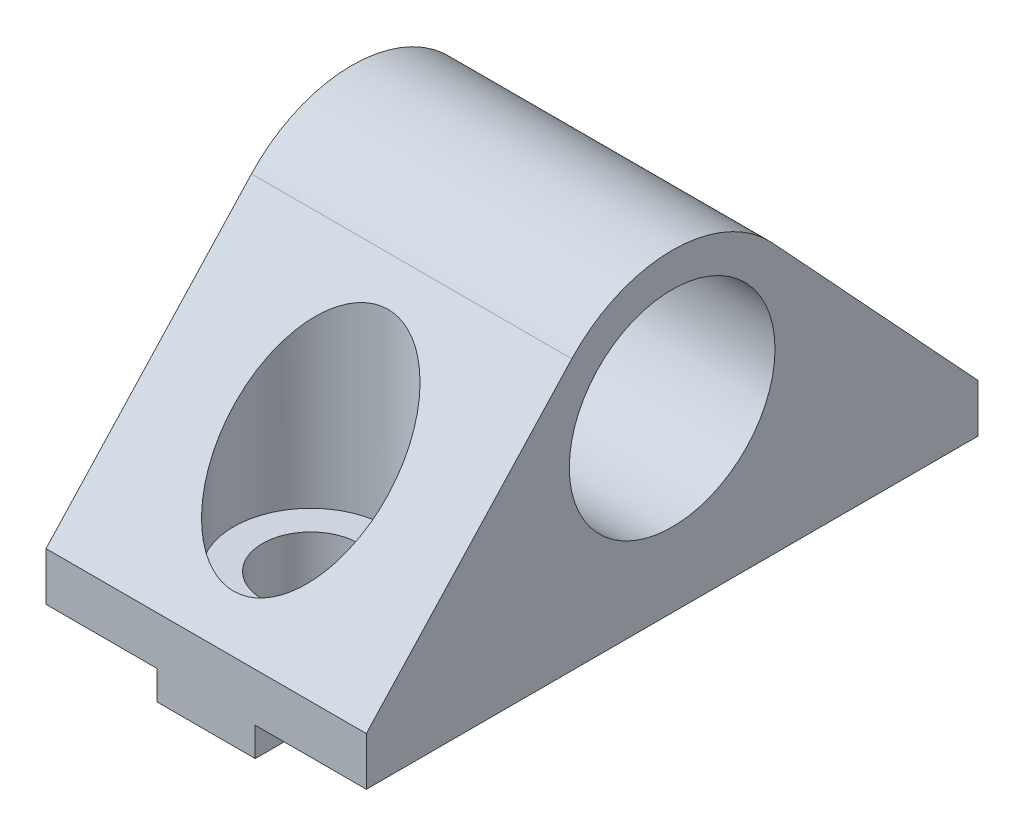
ISO-10303-21;
HEADER;
FILE_DESCRIPTION(('STEP AP214'),'2;1');
FILE_NAME('part.step','',(''),(''),'','','');
FILE_SCHEMA(('AUTOMOTIVE_DESIGN { 1 0 10303 214 1 1 1 1 }'));
ENDSEC;
DATA;
#1=APPLICATION_CONTEXT('core data for automotive mechanical design processes');
#2=APPLICATION_PROTOCOL_DEFINITION('international standard','automotive_design',2000,#1);
#3=PRODUCT_CONTEXT('',#1,'mechanical');
#4=PRODUCT('Part','Part','',(#3));
#5=PRODUCT_RELATED_PRODUCT_CATEGORY('part','',(#4));
#6=PRODUCT_DEFINITION_FORMATION('','',#4);
#7=PRODUCT_DEFINITION_CONTEXT('part definition',#1,'design');
#8=PRODUCT_DEFINITION('design','',#6,#7);
#9=PRODUCT_DEFINITION_SHAPE('','',#8);
#10=(LENGTH_UNIT() NAMED_UNIT(*) SI_UNIT(.MILLI.,.METRE.));
#11=(NAMED_UNIT(*) PLANE_ANGLE_UNIT() SI_UNIT($,.RADIAN.));
#12=(NAMED_UNIT(*) SI_UNIT($,.STERADIAN.) SOLID_ANGLE_UNIT());
#13=UNCERTAINTY_MEASURE_WITH_UNIT(LENGTH_MEASURE(1.E-05),#10,'distance_accuracy_value','');
#14=(GEOMETRIC_REPRESENTATION_CONTEXT(3) GLOBAL_UNCERTAINTY_ASSIGNED_CONTEXT((#13)) GLOBAL_UNIT_ASSIGNED_CONTEXT((#10,
#11,#12)) REPRESENTATION_CONTEXT('',''));
#15=CARTESIAN_POINT('',(0.,0.,0.));
#16=DIRECTION('',(0.,0.,1.));
#17=DIRECTION('',(1.,0.,0.));
#18=AXIS2_PLACEMENT_3D('',#15,#16,#17);
#19=CARTESIAN_POINT('',(101.606176910239,198.484265544604,-38.));
#20=DIRECTION('',(-1.,0.,0.));
#21=DIRECTION('',(0.,-1.,0.));
#22=AXIS2_PLACEMENT_3D('',#19,#20,#21);
#23=PLANE('',#22);
#24=DIRECTION('',(0.,-1.,0.));
#25=VECTOR('',#24,1.);
#26=CARTESIAN_POINT('',(101.606176910239,198.484265544604,0.));
#27=LINE('',#26,#25);
#28=CARTESIAN_POINT('',(101.606176910238,198.484265544604,0.));
#29=VERTEX_POINT('',#28);
#30=CARTESIAN_POINT('',(101.606176910239,195.484265544604,0.));
#31=VERTEX_POINT('',#30);
#32=EDGE_CURVE('E131',#29,#31,#27,.T.);
#33=ORIENTED_EDGE('',*,*,#32,.F.);
#34=DIRECTION('',(0.,0.733536752395156,-0.679649786938514));
#35=VECTOR('',#34,1.);
#36=CARTESIAN_POINT('',(101.606176910238,212.261288733581,-12.7649376046412));
#37=LINE('',#36,#35);
#38=CARTESIAN_POINT('',(101.606176910238,212.261288733581,-12.7649376046412));
#39=VERTEX_POINT('',#38);
#40=EDGE_CURVE('E189',#29,#39,#37,.T.);
#41=ORIENTED_EDGE('',*,*,#40,.T.);
#42=CARTESIAN_POINT('',(101.606176910238,206.484265544604,-19.));
#43=DIRECTION('',(-1.,0.,0.));
#44=DIRECTION('',(0.,0.,-1.));
#45=AXIS2_PLACEMENT_3D('',#42,#43,#44);
#46=CIRCLE('',#45,8.50000000000001);
#47=CARTESIAN_POINT('',(101.606176910238,212.261288733581,-25.2350623953588));
#48=VERTEX_POINT('',#47);
#49=EDGE_CURVE('E204',#39,#48,#46,.T.);
#50=ORIENTED_EDGE('',*,*,#49,.T.);
#51=DIRECTION('',(0.,-0.733536752395156,-0.679649786938514));
#52=VECTOR('',#51,1.);
#53=CARTESIAN_POINT('',(101.606176910238,198.484265544604,-38.));
#54=LINE('',#53,#52);
#55=CARTESIAN_POINT('',(101.606176910239,198.484265544604,-38.));
#56=VERTEX_POINT('',#55);
#57=EDGE_CURVE('E196',#48,#56,#54,.T.);
#58=ORIENTED_EDGE('',*,*,#57,.T.);
#59=DIRECTION('',(0.,-1.,0.));
#60=VECTOR('',#59,1.);
#61=CARTESIAN_POINT('',(101.606176910239,198.484265544604,-38.));
#62=LINE('',#61,#60);
#63=CARTESIAN_POINT('',(101.606176910239,195.484265544604,-38.));
#64=VERTEX_POINT('',#63);
#65=EDGE_CURVE('E52',#56,#64,#62,.T.);
#66=ORIENTED_EDGE('',*,*,#65,.T.);
#67=DIRECTION('',(0.,0.,1.));
#68=VECTOR('',#67,1.);
#69=CARTESIAN_POINT('',(101.606176910239,195.484265544604,-38.));
#70=LINE('',#69,#68);
#71=EDGE_CURVE('E93',#64,#31,#70,.T.);
#72=ORIENTED_EDGE('',*,*,#71,.T.);
#73=EDGE_LOOP('',(#33,#41,#50,#58,#66,#72));
#74=FACE_BOUND('',#73,.T.);
#75=CARTESIAN_POINT('',(101.606176910238,206.484265544604,-19.));
#76=DIRECTION('',(-1.,0.,0.));
#77=DIRECTION('',(0.,0.,1.));
#78=AXIS2_PLACEMENT_3D('',#75,#76,#77);
#79=CIRCLE('',#78,6.39);
#80=CARTESIAN_POINT('',(101.606176910238,206.484265544604,-12.61));
#81=VERTEX_POINT('',#80);
#82=EDGE_CURVE('E166',#81,#81,#79,.T.);
#83=ORIENTED_EDGE('',*,*,#82,.F.);
#84=EDGE_LOOP('',(#83));
#85=FACE_BOUND('',#84,.T.);
#86=ADVANCED_FACE('F34',(#74,#85),#23,.T.);
#87=CARTESIAN_POINT('',(121.506176910239,195.484265544604,-38.));
#88=DIRECTION('',(1.,0.,0.));
#89=DIRECTION('',(0.,0.,-1.));
#90=AXIS2_PLACEMENT_3D('',#87,#88,#89);
#91=PLANE('',#90);
#92=DIRECTION('',(0.,1.,0.));
#93=VECTOR('',#92,1.);
#94=CARTESIAN_POINT('',(121.506176910239,195.484265544604,0.));
#95=LINE('',#94,#93);
#96=CARTESIAN_POINT('',(121.506176910239,195.484265544604,0.));
#97=VERTEX_POINT('',#96);
#98=CARTESIAN_POINT('',(121.506176910239,198.484265544604,0.));
#99=VERTEX_POINT('',#98);
#100=EDGE_CURVE('E85',#97,#99,#95,.T.);
#101=ORIENTED_EDGE('',*,*,#100,.F.);
#102=DIRECTION('',(0.,0.,1.));
#103=VECTOR('',#102,1.);
#104=CARTESIAN_POINT('',(121.506176910239,195.484265544604,-38.));
#105=LINE('',#104,#103);
#106=CARTESIAN_POINT('',(121.506176910239,195.484265544604,-38.));
#107=VERTEX_POINT('',#106);
#108=EDGE_CURVE('E11',#107,#97,#105,.T.);
#109=ORIENTED_EDGE('',*,*,#108,.F.);
#110=DIRECTION('',(0.,1.,0.));
#111=VECTOR('',#110,1.);
#112=CARTESIAN_POINT('',(121.506176910239,195.484265544604,-38.));
#113=LINE('',#112,#111);
#114=CARTESIAN_POINT('',(121.506176910239,198.484265544604,-38.));
#115=VERTEX_POINT('',#114);
#116=EDGE_CURVE('E113',#107,#115,#113,.T.);
#117=ORIENTED_EDGE('',*,*,#116,.T.);
#118=DIRECTION('',(0.,-0.733536752395156,-0.679649786938514));
#119=VECTOR('',#118,1.);
#120=CARTESIAN_POINT('',(121.506176910239,198.484265544604,-38.));
#121=LINE('',#120,#119);
#122=CARTESIAN_POINT('',(121.506176910239,212.261288733581,-25.2350623953588));
#123=VERTEX_POINT('',#122);
#124=EDGE_CURVE('E199',#123,#115,#121,.T.);
#125=ORIENTED_EDGE('',*,*,#124,.F.);
#126=CARTESIAN_POINT('',(121.506176910239,206.484265544604,-19.));
#127=DIRECTION('',(-1.,0.,0.));
#128=DIRECTION('',(0.,0.,-1.));
#129=AXIS2_PLACEMENT_3D('',#126,#127,#128);
#130=CIRCLE('',#129,8.50000000000001);
#131=CARTESIAN_POINT('',(121.506176910239,212.261288733581,-12.7649376046412));
#132=VERTEX_POINT('',#131);
#133=EDGE_CURVE('E195',#132,#123,#130,.T.);
#134=ORIENTED_EDGE('',*,*,#133,.F.);
#135=DIRECTION('',(0.,0.733536752395156,-0.679649786938514));
#136=VECTOR('',#135,1.);
#137=CARTESIAN_POINT('',(121.506176910239,212.261288733581,-12.7649376046412));
#138=LINE('',#137,#136);
#139=EDGE_CURVE('E192',#99,#132,#138,.T.);
#140=ORIENTED_EDGE('',*,*,#139,.F.);
#141=EDGE_LOOP('',(#101,#109,#117,#125,#134,#140));
#142=FACE_BOUND('',#141,.T.);
#143=CARTESIAN_POINT('',(121.506176910239,206.484265544604,-19.));
#144=DIRECTION('',(-1.,0.,0.));
#145=DIRECTION('',(0.,0.,1.));
#146=AXIS2_PLACEMENT_3D('',#143,#144,#145);
#147=CIRCLE('',#146,6.39);
#148=CARTESIAN_POINT('',(121.506176910239,206.484265544604,-12.61));
#149=VERTEX_POINT('',#148);
#150=EDGE_CURVE('E186',#149,#149,#147,.T.);
#151=ORIENTED_EDGE('',*,*,#150,.T.);
#152=EDGE_LOOP('',(#151));
#153=FACE_BOUND('',#152,.T.);
#154=ADVANCED_FACE('F110',(#142,#153),#91,.T.);
#155=CARTESIAN_POINT('',(114.604851947764,195.484265544604,-38.));
#156=DIRECTION('',(0.,-1.,0.));
#157=DIRECTION('',(0.,0.,-1.));
#158=AXIS2_PLACEMENT_3D('',#155,#156,#157);
#159=PLANE('',#158);
#160=DIRECTION('',(1.,0.,0.));
#161=VECTOR('',#160,1.);
#162=CARTESIAN_POINT('',(114.604851947764,195.484265544604,0.));
#163=LINE('',#162,#161);
#164=CARTESIAN_POINT('',(114.604851947764,195.484265544604,0.));
#165=VERTEX_POINT('',#164);
#166=EDGE_CURVE('E147',#165,#97,#163,.T.);
#167=ORIENTED_EDGE('',*,*,#166,.F.);
#168=DIRECTION('',(0.,0.,1.));
#169=VECTOR('',#168,1.);
#170=CARTESIAN_POINT('',(114.604851947764,195.484265544604,-38.));
#171=LINE('',#170,#169);
#172=CARTESIAN_POINT('',(114.604851947764,195.484265544604,-38.));
#173=VERTEX_POINT('',#172);
#174=EDGE_CURVE('E43',#173,#165,#171,.T.);
#175=ORIENTED_EDGE('',*,*,#174,.F.);
#176=DIRECTION('',(1.,0.,0.));
#177=VECTOR('',#176,1.);
#178=CARTESIAN_POINT('',(114.604851947764,195.484265544604,-38.));
#179=LINE('',#178,#177);
#180=EDGE_CURVE('E118',#173,#107,#179,.T.);
#181=ORIENTED_EDGE('',*,*,#180,.T.);
#182=ORIENTED_EDGE('',*,*,#108,.T.);
#183=EDGE_LOOP('',(#167,#175,#181,#182));
#184=FACE_BOUND('',#183,.T.);
#185=ADVANCED_FACE('F123',(#184),#159,.T.);
#186=CARTESIAN_POINT('',(114.604851947764,193.684265544604,-38.));
#187=DIRECTION('',(1.,0.,0.));
#188=DIRECTION('',(0.,1.,0.));
#189=AXIS2_PLACEMENT_3D('',#186,#187,#188);
#190=PLANE('',#189);
#191=DIRECTION('',(0.,1.,0.));
#192=VECTOR('',#191,1.);
#193=CARTESIAN_POINT('',(114.604851947764,193.684265544604,0.));
#194=LINE('',#193,#192);
#195=CARTESIAN_POINT('',(114.604851947764,193.684265544604,0.));
#196=VERTEX_POINT('',#195);
#197=EDGE_CURVE('E144',#196,#165,#194,.T.);
#198=ORIENTED_EDGE('',*,*,#197,.F.);
#199=DIRECTION('',(0.,0.,1.));
#200=VECTOR('',#199,1.);
#201=CARTESIAN_POINT('',(114.604851947764,193.684265544604,-38.));
#202=LINE('',#201,#200);
#203=CARTESIAN_POINT('',(114.604851947764,193.684265544604,-38.));
#204=VERTEX_POINT('',#203);
#205=EDGE_CURVE('E153',#204,#196,#202,.T.);
#206=ORIENTED_EDGE('',*,*,#205,.F.);
#207=DIRECTION('',(0.,1.,0.));
#208=VECTOR('',#207,1.);
#209=CARTESIAN_POINT('',(114.604851947764,193.684265544604,-38.));
#210=LINE('',#209,#208);
#211=EDGE_CURVE('E124',#204,#173,#210,.T.);
#212=ORIENTED_EDGE('',*,*,#211,.T.);
#213=ORIENTED_EDGE('',*,*,#174,.T.);
#214=EDGE_LOOP('',(#198,#206,#212,#213));
#215=FACE_BOUND('',#214,.T.);
#216=ADVANCED_FACE('F271',(#215),#190,.T.);
#217=CARTESIAN_POINT('',(108.516176910239,193.684265544604,-38.));
#218=DIRECTION('',(0.,-1.,0.));
#219=DIRECTION('',(0.,0.,-1.));
#220=AXIS2_PLACEMENT_3D('',#217,#218,#219);
#221=PLANE('',#220);
#222=CARTESIAN_POINT('',(111.556176910238,193.684265544604,-6.5));
#223=DIRECTION('',(0.,-1.,0.));
#224=DIRECTION('',(0.,0.,-1.));
#225=AXIS2_PLACEMENT_3D('',#222,#223,#224);
#226=CIRCLE('',#225,3.);
#227=CARTESIAN_POINT('',(111.556176910238,193.684265544604,-9.5));
#228=VERTEX_POINT('',#227);
#229=EDGE_CURVE('E37',#228,#228,#226,.T.);
#230=ORIENTED_EDGE('',*,*,#229,.F.);
#231=EDGE_LOOP('',(#230));
#232=FACE_BOUND('',#231,.T.);
#233=CARTESIAN_POINT('',(111.556176910238,193.684265544604,-31.5));
#234=DIRECTION('',(0.,-1.,0.));
#235=DIRECTION('',(0.,0.,-1.));
#236=AXIS2_PLACEMENT_3D('',#233,#234,#235);
#237=CIRCLE('',#236,3.);
#238=CARTESIAN_POINT('',(111.556176910238,193.684265544604,-34.5));
#239=VERTEX_POINT('',#238);
#240=EDGE_CURVE('E163',#239,#239,#237,.T.);
#241=ORIENTED_EDGE('',*,*,#240,.F.);
#242=EDGE_LOOP('',(#241));
#243=FACE_BOUND('',#242,.T.);
#244=DIRECTION('',(1.,0.,0.));
#245=VECTOR('',#244,1.);
#246=CARTESIAN_POINT('',(108.516176910239,193.684265544604,0.));
#247=LINE('',#246,#245);
#248=CARTESIAN_POINT('',(108.516176910239,193.684265544604,0.));
#249=VERTEX_POINT('',#248);
#250=EDGE_CURVE('E141',#249,#196,#247,.T.);
#251=ORIENTED_EDGE('',*,*,#250,.F.);
#252=DIRECTION('',(0.,0.,1.));
#253=VECTOR('',#252,1.);
#254=CARTESIAN_POINT('',(108.516176910239,193.684265544604,-38.));
#255=LINE('',#254,#253);
#256=CARTESIAN_POINT('',(108.516176910239,193.684265544604,-38.));
#257=VERTEX_POINT('',#256);
#258=EDGE_CURVE('E155',#257,#249,#255,.T.);
#259=ORIENTED_EDGE('',*,*,#258,.F.);
#260=DIRECTION('',(1.,0.,0.));
#261=VECTOR('',#260,1.);
#262=CARTESIAN_POINT('',(108.516176910239,193.684265544604,-38.));
#263=LINE('',#262,#261);
#264=EDGE_CURVE('E126',#257,#204,#263,.T.);
#265=ORIENTED_EDGE('',*,*,#264,.T.);
#266=ORIENTED_EDGE('',*,*,#205,.T.);
#267=EDGE_LOOP('',(#251,#259,#265,#266));
#268=FACE_BOUND('',#267,.T.);
#269=ADVANCED_FACE('F222',(#232,#243,#268),#221,.T.);
#270=CARTESIAN_POINT('',(108.516176910239,195.484265544604,-38.));
#271=DIRECTION('',(-1.,0.,0.));
#272=DIRECTION('',(0.,0.,1.));
#273=AXIS2_PLACEMENT_3D('',#270,#271,#272);
#274=PLANE('',#273);
#275=DIRECTION('',(0.,-1.,0.));
#276=VECTOR('',#275,1.);
#277=CARTESIAN_POINT('',(108.516176910239,195.484265544604,0.));
#278=LINE('',#277,#276);
#279=CARTESIAN_POINT('',(108.516176910239,195.484265544604,0.));
#280=VERTEX_POINT('',#279);
#281=EDGE_CURVE('E138',#280,#249,#278,.T.);
#282=ORIENTED_EDGE('',*,*,#281,.F.);
#283=DIRECTION('',(0.,0.,1.));
#284=VECTOR('',#283,1.);
#285=CARTESIAN_POINT('',(108.516176910239,195.484265544604,-38.));
#286=LINE('',#285,#284);
#287=CARTESIAN_POINT('',(108.516176910239,195.484265544604,-38.));
#288=VERTEX_POINT('',#287);
#289=EDGE_CURVE('E157',#288,#280,#286,.T.);
#290=ORIENTED_EDGE('',*,*,#289,.F.);
#291=DIRECTION('',(0.,-1.,0.));
#292=VECTOR('',#291,1.);
#293=CARTESIAN_POINT('',(108.516176910239,195.484265544604,-38.));
#294=LINE('',#293,#292);
#295=EDGE_CURVE('E216',#288,#257,#294,.T.);
#296=ORIENTED_EDGE('',*,*,#295,.T.);
#297=ORIENTED_EDGE('',*,*,#258,.T.);
#298=EDGE_LOOP('',(#282,#290,#296,#297));
#299=FACE_BOUND('',#298,.T.);
#300=ADVANCED_FACE('F227',(#299),#274,.T.);
#301=CARTESIAN_POINT('',(101.606176910239,195.484265544604,-38.));
#302=DIRECTION('',(0.,-1.,0.));
#303=DIRECTION('',(0.,0.,-1.));
#304=AXIS2_PLACEMENT_3D('',#301,#302,#303);
#305=PLANE('',#304);
#306=DIRECTION('',(1.,0.,0.));
#307=VECTOR('',#306,1.);
#308=CARTESIAN_POINT('',(101.606176910239,195.484265544604,0.));
#309=LINE('',#308,#307);
#310=EDGE_CURVE('E134',#31,#280,#309,.T.);
#311=ORIENTED_EDGE('',*,*,#310,.F.);
#312=ORIENTED_EDGE('',*,*,#71,.F.);
#313=DIRECTION('',(1.,0.,0.));
#314=VECTOR('',#313,1.);
#315=CARTESIAN_POINT('',(101.606176910239,195.484265544604,-38.));
#316=LINE('',#315,#314);
#317=EDGE_CURVE('E214',#64,#288,#316,.T.);
#318=ORIENTED_EDGE('',*,*,#317,.T.);
#319=ORIENTED_EDGE('',*,*,#289,.T.);
#320=EDGE_LOOP('',(#311,#312,#318,#319));
#321=FACE_BOUND('',#320,.T.);
#322=ADVANCED_FACE('F228',(#321),#305,.T.);
#323=CARTESIAN_POINT('',(101.606176910239,195.484265544604,-38.));
#324=DIRECTION('',(0.,0.,1.));
#325=DIRECTION('',(1.,0.,0.));
#326=AXIS2_PLACEMENT_3D('',#323,#324,#325);
#327=PLANE('',#326);
#328=ORIENTED_EDGE('',*,*,#65,.F.);
#329=DIRECTION('',(-1.,0.,0.));
#330=VECTOR('',#329,1.);
#331=CARTESIAN_POINT('',(121.506176910239,198.484265544604,-38.));
#332=LINE('',#331,#330);
#333=EDGE_CURVE('E120',#115,#56,#332,.T.);
#334=ORIENTED_EDGE('',*,*,#333,.F.);
#335=ORIENTED_EDGE('',*,*,#116,.F.);
#336=ORIENTED_EDGE('',*,*,#180,.F.);
#337=ORIENTED_EDGE('',*,*,#211,.F.);
#338=ORIENTED_EDGE('',*,*,#264,.F.);
#339=ORIENTED_EDGE('',*,*,#295,.F.);
#340=ORIENTED_EDGE('',*,*,#317,.F.);
#341=EDGE_LOOP('',(#328,#334,#335,#336,#337,#338,#339,#340));
#342=FACE_BOUND('',#341,.T.);
#343=ADVANCED_FACE('F116',(#342),#327,.F.);
#344=CARTESIAN_POINT('',(101.606176910239,195.484265544604,0.));
#345=DIRECTION('',(0.,0.,1.));
#346=DIRECTION('',(1.,0.,0.));
#347=AXIS2_PLACEMENT_3D('',#344,#345,#346);
#348=PLANE('',#347);
#349=ORIENTED_EDGE('',*,*,#32,.T.);
#350=ORIENTED_EDGE('',*,*,#310,.T.);
#351=ORIENTED_EDGE('',*,*,#281,.T.);
#352=ORIENTED_EDGE('',*,*,#250,.T.);
#353=ORIENTED_EDGE('',*,*,#197,.T.);
#354=ORIENTED_EDGE('',*,*,#166,.T.);
#355=ORIENTED_EDGE('',*,*,#100,.T.);
#356=DIRECTION('',(-1.,0.,0.));
#357=VECTOR('',#356,1.);
#358=CARTESIAN_POINT('',(121.506176910239,198.484265544604,0.));
#359=LINE('',#358,#357);
#360=EDGE_CURVE('E150',#99,#29,#359,.T.);
#361=ORIENTED_EDGE('',*,*,#360,.T.);
#362=EDGE_LOOP('',(#349,#350,#351,#352,#353,#354,#355,#361));
#363=FACE_BOUND('',#362,.T.);
#364=ADVANCED_FACE('F247',(#363),#348,.T.);
#365=CARTESIAN_POINT('',(121.506176910239,198.484265544604,-38.));
#366=DIRECTION('',(0.,0.679649786938514,-0.733536752395156));
#367=DIRECTION('',(0.,0.733536752395156,0.679649786938514));
#368=AXIS2_PLACEMENT_3D('',#365,#366,#367);
#369=PLANE('',#368);
#370=CARTESIAN_POINT('',(111.556176910238,205.499626958967,-31.5));
#371=DIRECTION('',(0.,0.679649786938514,-0.733536752395156));
#372=DIRECTION('',(0.,-0.733536752395156,-0.679649786938514));
#373=AXIS2_PLACEMENT_3D('',#370,#371,#372);
#374=ELLIPSE('',#373,7.06246083239667,4.8);
#375=CARTESIAN_POINT('',(111.556176910238,200.319052376053,-36.3));
#376=VERTEX_POINT('',#375);
#377=EDGE_CURVE('E160',#376,#376,#374,.T.);
#378=ORIENTED_EDGE('',*,*,#377,.F.);
#379=EDGE_LOOP('',(#378));
#380=FACE_BOUND('',#379,.T.);
#381=ORIENTED_EDGE('',*,*,#57,.F.);
#382=DIRECTION('',(-1.,0.,0.));
#383=VECTOR('',#382,1.);
#384=CARTESIAN_POINT('',(121.506176910239,212.261288733581,-25.2350623953588));
#385=LINE('',#384,#383);
#386=EDGE_CURVE('E135',#123,#48,#385,.T.);
#387=ORIENTED_EDGE('',*,*,#386,.F.);
#388=ORIENTED_EDGE('',*,*,#124,.T.);
#389=ORIENTED_EDGE('',*,*,#333,.T.);
#390=EDGE_LOOP('',(#381,#387,#388,#389));
#391=FACE_BOUND('',#390,.T.);
#392=ADVANCED_FACE('F236',(#380,#391),#369,.T.);
#393=CARTESIAN_POINT('',(121.506176910239,206.484265544604,-19.));
#394=DIRECTION('',(-1.,0.,0.));
#395=DIRECTION('',(0.,0.,1.));
#396=AXIS2_PLACEMENT_3D('',#393,#394,#395);
#397=CYLINDRICAL_SURFACE('',#396,8.50000000000001);
#398=ORIENTED_EDGE('',*,*,#49,.F.);
#399=DIRECTION('',(-1.,0.,0.));
#400=VECTOR('',#399,1.);
#401=CARTESIAN_POINT('',(121.506176910239,212.261288733581,-12.7649376046412));
#402=LINE('',#401,#400);
#403=EDGE_CURVE('E201',#132,#39,#402,.T.);
#404=ORIENTED_EDGE('',*,*,#403,.F.);
#405=ORIENTED_EDGE('',*,*,#133,.T.);
#406=ORIENTED_EDGE('',*,*,#386,.T.);
#407=EDGE_LOOP('',(#398,#404,#405,#406));
#408=FACE_BOUND('',#407,.T.);
#409=ADVANCED_FACE('F251',(#408),#397,.T.);
#410=CARTESIAN_POINT('',(121.506176910239,212.261288733581,-12.7649376046412));
#411=DIRECTION('',(0.,0.679649786938515,0.733536752395156));
#412=DIRECTION('',(0.,-0.733536752395156,0.679649786938515));
#413=AXIS2_PLACEMENT_3D('',#410,#411,#412);
#414=PLANE('',#413);
#415=CARTESIAN_POINT('',(111.556176910238,205.499626958967,-6.5));
#416=DIRECTION('',(0.,0.679649786938515,0.733536752395156));
#417=DIRECTION('',(0.,-0.733536752395156,0.679649786938515));
#418=AXIS2_PLACEMENT_3D('',#415,#416,#417);
#419=ELLIPSE('',#418,7.06246083239667,4.8);
#420=CARTESIAN_POINT('',(111.556176910238,200.319052376053,-1.7));
#421=VERTEX_POINT('',#420);
#422=EDGE_CURVE('E167',#421,#421,#419,.T.);
#423=ORIENTED_EDGE('',*,*,#422,.F.);
#424=EDGE_LOOP('',(#423));
#425=FACE_BOUND('',#424,.T.);
#426=ORIENTED_EDGE('',*,*,#40,.F.);
#427=ORIENTED_EDGE('',*,*,#360,.F.);
#428=ORIENTED_EDGE('',*,*,#139,.T.);
#429=ORIENTED_EDGE('',*,*,#403,.T.);
#430=EDGE_LOOP('',(#426,#427,#428,#429));
#431=FACE_BOUND('',#430,.T.);
#432=ADVANCED_FACE('F248',(#425,#431),#414,.T.);
#433=CARTESIAN_POINT('',(121.506176910239,206.484265544604,-19.));
#434=DIRECTION('',(-1.,0.,0.));
#435=DIRECTION('',(0.,0.,1.));
#436=AXIS2_PLACEMENT_3D('',#433,#434,#435);
#437=CYLINDRICAL_SURFACE('',#436,6.39);
#438=ORIENTED_EDGE('',*,*,#150,.F.);
#439=EDGE_LOOP('',(#438));
#440=FACE_BOUND('',#439,.T.);
#441=ORIENTED_EDGE('',*,*,#82,.T.);
#442=EDGE_LOOP('',(#441));
#443=FACE_BOUND('',#442,.T.);
#444=ADVANCED_FACE('F250',(#440,#443),#437,.F.);
#445=CARTESIAN_POINT('',(111.556176910238,189.90606828779,-31.5));
#446=DIRECTION('',(0.,-1.,0.));
#447=DIRECTION('',(1.,0.,0.));
#448=AXIS2_PLACEMENT_3D('',#445,#446,#447);
#449=CYLINDRICAL_SURFACE('',#448,3.);
#450=ORIENTED_EDGE('',*,*,#240,.T.);
#451=EDGE_LOOP('',(#450));
#452=FACE_BOUND('',#451,.T.);
#453=CARTESIAN_POINT('',(111.556176910238,198.985665544604,-31.5));
#454=DIRECTION('',(0.,-1.,0.));
#455=DIRECTION('',(1.,0.,0.));
#456=AXIS2_PLACEMENT_3D('',#453,#454,#455);
#457=CIRCLE('',#456,3.);
#458=CARTESIAN_POINT('',(114.556176910238,198.985665544604,-31.5));
#459=VERTEX_POINT('',#458);
#460=EDGE_CURVE('E164',#459,#459,#457,.T.);
#461=ORIENTED_EDGE('',*,*,#460,.F.);
#462=EDGE_LOOP('',(#461));
#463=FACE_BOUND('',#462,.T.);
#464=ADVANCED_FACE('F258',(#452,#463),#449,.F.);
#465=CARTESIAN_POINT('',(111.556176910238,198.985665544604,-26.7));
#466=DIRECTION('',(0.,-1.,0.));
#467=DIRECTION('',(1.,0.,0.));
#468=AXIS2_PLACEMENT_3D('',#465,#466,#467);
#469=PLANE('',#468);
#470=CARTESIAN_POINT('',(111.556176910238,198.985665544604,-31.5));
#471=DIRECTION('',(0.,-1.,0.));
#472=DIRECTION('',(1.,0.,0.));
#473=AXIS2_PLACEMENT_3D('',#470,#471,#472);
#474=CIRCLE('',#473,4.8);
#475=CARTESIAN_POINT('',(116.356176910238,198.985665544604,-31.5));
#476=VERTEX_POINT('',#475);
#477=EDGE_CURVE('E173',#476,#476,#474,.T.);
#478=ORIENTED_EDGE('',*,*,#477,.F.);
#479=EDGE_LOOP('',(#478));
#480=FACE_BOUND('',#479,.T.);
#481=ORIENTED_EDGE('',*,*,#460,.T.);
#482=EDGE_LOOP('',(#481));
#483=FACE_BOUND('',#482,.T.);
#484=ADVANCED_FACE('F300',(#480,#483),#469,.F.);
#485=CARTESIAN_POINT('',(111.556176910238,189.90606828779,-31.5));
#486=DIRECTION('',(0.,-1.,0.));
#487=DIRECTION('',(1.,0.,0.));
#488=AXIS2_PLACEMENT_3D('',#485,#486,#487);
#489=CYLINDRICAL_SURFACE('',#488,4.8);
#490=ORIENTED_EDGE('',*,*,#377,.T.);
#491=EDGE_LOOP('',(#490));
#492=FACE_BOUND('',#491,.T.);
#493=ORIENTED_EDGE('',*,*,#477,.T.);
#494=EDGE_LOOP('',(#493));
#495=FACE_BOUND('',#494,.T.);
#496=ADVANCED_FACE('F304',(#492,#495),#489,.F.);
#497=CARTESIAN_POINT('',(111.556176910238,189.90606828779,-6.5));
#498=DIRECTION('',(0.,-1.,0.));
#499=DIRECTION('',(1.,0.,0.));
#500=AXIS2_PLACEMENT_3D('',#497,#498,#499);
#501=CYLINDRICAL_SURFACE('',#500,3.);
#502=ORIENTED_EDGE('',*,*,#229,.T.);
#503=EDGE_LOOP('',(#502));
#504=FACE_BOUND('',#503,.T.);
#505=CARTESIAN_POINT('',(111.556176910238,198.985665544604,-6.5));
#506=DIRECTION('',(0.,1.,0.));
#507=DIRECTION('',(1.,0.,0.));
#508=AXIS2_PLACEMENT_3D('',#505,#506,#507);
#509=CIRCLE('',#508,3.);
#510=CARTESIAN_POINT('',(114.556176910238,198.985665544604,-6.5));
#511=VERTEX_POINT('',#510);
#512=EDGE_CURVE('E169',#511,#511,#509,.T.);
#513=ORIENTED_EDGE('',*,*,#512,.T.);
#514=EDGE_LOOP('',(#513));
#515=FACE_BOUND('',#514,.T.);
#516=ADVANCED_FACE('F308',(#504,#515),#501,.F.);
#517=CARTESIAN_POINT('',(111.556176910238,198.985665544604,-11.3));
#518=DIRECTION('',(0.,-1.,0.));
#519=DIRECTION('',(1.,0.,0.));
#520=AXIS2_PLACEMENT_3D('',#517,#518,#519);
#521=PLANE('',#520);
#522=CARTESIAN_POINT('',(111.556176910238,198.985665544604,-6.5));
#523=DIRECTION('',(0.,1.,0.));
#524=DIRECTION('',(1.,0.,0.));
#525=AXIS2_PLACEMENT_3D('',#522,#523,#524);
#526=CIRCLE('',#525,4.8);
#527=CARTESIAN_POINT('',(116.356176910238,198.985665544604,-6.5));
#528=VERTEX_POINT('',#527);
#529=EDGE_CURVE('E175',#528,#528,#526,.T.);
#530=ORIENTED_EDGE('',*,*,#529,.T.);
#531=EDGE_LOOP('',(#530));
#532=FACE_BOUND('',#531,.T.);
#533=ORIENTED_EDGE('',*,*,#512,.F.);
#534=EDGE_LOOP('',(#533));
#535=FACE_BOUND('',#534,.T.);
#536=ADVANCED_FACE('F312',(#532,#535),#521,.F.);
#537=CARTESIAN_POINT('',(111.556176910238,189.90606828779,-6.5));
#538=DIRECTION('',(0.,-1.,0.));
#539=DIRECTION('',(1.,0.,0.));
#540=AXIS2_PLACEMENT_3D('',#537,#538,#539);
#541=CYLINDRICAL_SURFACE('',#540,4.8);
#542=ORIENTED_EDGE('',*,*,#422,.T.);
#543=EDGE_LOOP('',(#542));
#544=FACE_BOUND('',#543,.T.);
#545=ORIENTED_EDGE('',*,*,#529,.F.);
#546=EDGE_LOOP('',(#545));
#547=FACE_BOUND('',#546,.T.);
#548=ADVANCED_FACE('F316',(#544,#547),#541,.F.);
#549=CLOSED_SHELL('',(#86,#154,#185,#216,#269,#300,#322,#343,#364,#392,#409,#432,#444,#464,#484,
#496,#516,#536,#548));
#550=MANIFOLD_SOLID_BREP('B2',#549);
#551=ADVANCED_BREP_SHAPE_REPRESENTATION('',(#18,#550),#14);
#552=SHAPE_DEFINITION_REPRESENTATION(#9,#551);
ENDSEC;
END-ISO-10303-21;
